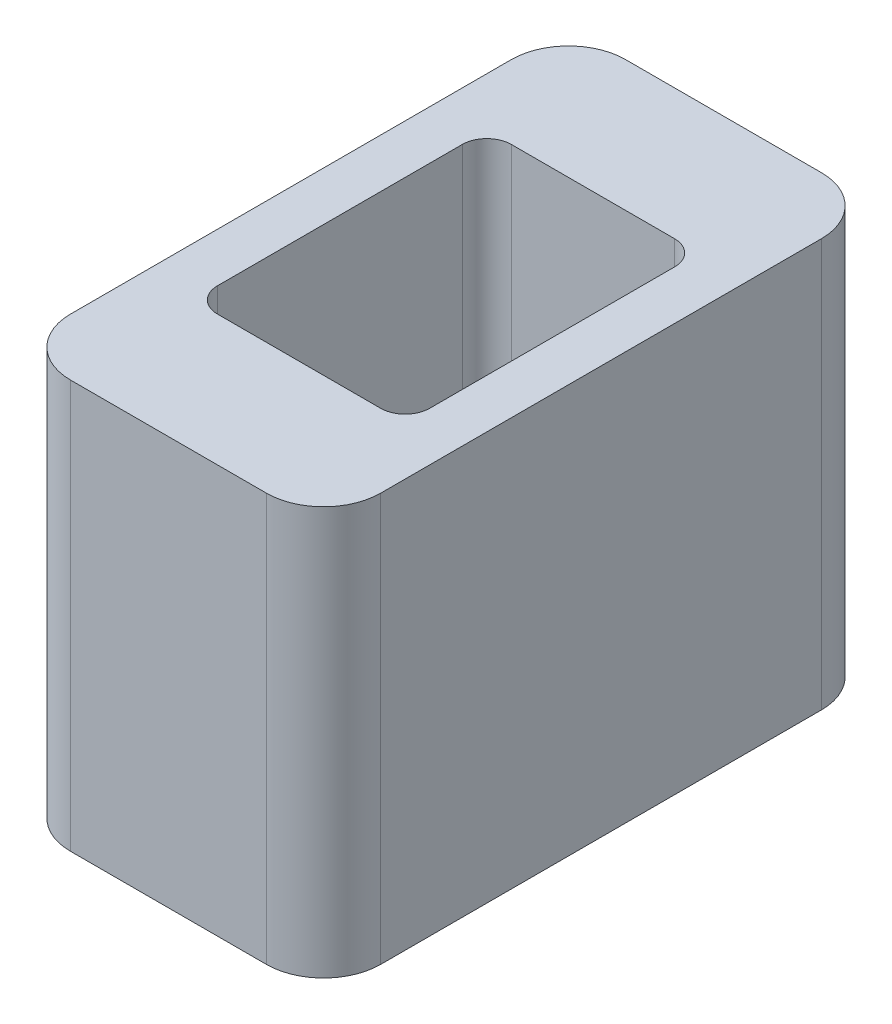
ISO-10303-21;
HEADER;
FILE_DESCRIPTION(('STEP AP214'),'2;1');
FILE_NAME('part.step','',(''),(''),'','','');
FILE_SCHEMA(('AUTOMOTIVE_DESIGN { 1 0 10303 214 1 1 1 1 }'));
ENDSEC;
DATA;
#1=APPLICATION_CONTEXT('core data for automotive mechanical design processes');
#2=APPLICATION_PROTOCOL_DEFINITION('international standard','automotive_design',2000,#1);
#3=PRODUCT_CONTEXT('',#1,'mechanical');
#4=PRODUCT('Part','Part','',(#3));
#5=PRODUCT_RELATED_PRODUCT_CATEGORY('part','',(#4));
#6=PRODUCT_DEFINITION_FORMATION('','',#4);
#7=PRODUCT_DEFINITION_CONTEXT('part definition',#1,'design');
#8=PRODUCT_DEFINITION('design','',#6,#7);
#9=PRODUCT_DEFINITION_SHAPE('','',#8);
#10=(LENGTH_UNIT() NAMED_UNIT(*) SI_UNIT(.MILLI.,.METRE.));
#11=(NAMED_UNIT(*) PLANE_ANGLE_UNIT() SI_UNIT($,.RADIAN.));
#12=(NAMED_UNIT(*) SI_UNIT($,.STERADIAN.) SOLID_ANGLE_UNIT());
#13=UNCERTAINTY_MEASURE_WITH_UNIT(LENGTH_MEASURE(1.E-05),#10,'distance_accuracy_value','');
#14=(GEOMETRIC_REPRESENTATION_CONTEXT(3) GLOBAL_UNCERTAINTY_ASSIGNED_CONTEXT((#13)) GLOBAL_UNIT_ASSIGNED_CONTEXT((#10,
#11,#12)) REPRESENTATION_CONTEXT('',''));
#15=CARTESIAN_POINT('',(0.,0.,0.));
#16=DIRECTION('',(0.,0.,1.));
#17=DIRECTION('',(1.,0.,0.));
#18=AXIS2_PLACEMENT_3D('',#15,#16,#17);
#19=CARTESIAN_POINT('',(-55.3410968965142,8.00000000000036,-55.2200768086937));
#20=DIRECTION('',(0.,-1.,0.));
#21=DIRECTION('',(-1.,0.,0.));
#22=AXIS2_PLACEMENT_3D('',#19,#20,#21);
#23=PLANE('',#22);
#24=DIRECTION('',(-1.,0.,0.));
#25=VECTOR('',#24,1.);
#26=CARTESIAN_POINT('',(3.57000000000008,8.,2.79999999999879));
#27=LINE('',#26,#25);
#28=CARTESIAN_POINT('',(3.57000000000008,8.,2.79999999999879));
#29=VERTEX_POINT('',#28);
#30=CARTESIAN_POINT('',(1.57000000000014,8.,2.79999999999879));
#31=VERTEX_POINT('',#30);
#32=EDGE_CURVE('E282',#29,#31,#27,.T.);
#33=ORIENTED_EDGE('',*,*,#32,.F.);
#34=CARTESIAN_POINT('',(3.57000000000008,8.,3.09999999999888));
#35=DIRECTION('',(0.,-1.,0.));
#36=DIRECTION('',(1.,0.,0.));
#37=AXIS2_PLACEMENT_3D('',#34,#35,#36);
#38=CIRCLE('',#37,0.300000000000047);
#39=CARTESIAN_POINT('',(3.87000000000006,7.9999999999999,3.09999999999888));
#40=VERTEX_POINT('',#39);
#41=EDGE_CURVE('E186',#29,#40,#38,.T.);
#42=ORIENTED_EDGE('',*,*,#41,.T.);
#43=DIRECTION('',(0.,0.,1.));
#44=VECTOR('',#43,1.);
#45=CARTESIAN_POINT('',(3.87000000000006,7.9999999999999,3.09999999999888));
#46=LINE('',#45,#44);
#47=CARTESIAN_POINT('',(3.87000000000006,7.9999999999999,6.09999999999889));
#48=VERTEX_POINT('',#47);
#49=EDGE_CURVE('E196',#40,#48,#46,.T.);
#50=ORIENTED_EDGE('',*,*,#49,.T.);
#51=CARTESIAN_POINT('',(3.57000000000008,8.,6.09999999999889));
#52=DIRECTION('',(0.,-1.,0.));
#53=DIRECTION('',(1.,0.,0.));
#54=AXIS2_PLACEMENT_3D('',#51,#52,#53);
#55=CIRCLE('',#54,0.29999999999994);
#56=CARTESIAN_POINT('',(3.57000000000008,8.,6.39999999999878));
#57=VERTEX_POINT('',#56);
#58=EDGE_CURVE('E177',#48,#57,#55,.T.);
#59=ORIENTED_EDGE('',*,*,#58,.T.);
#60=DIRECTION('',(1.,0.,0.));
#61=VECTOR('',#60,1.);
#62=CARTESIAN_POINT('',(1.57000000000014,8.,6.3999999999989));
#63=LINE('',#62,#61);
#64=CARTESIAN_POINT('',(1.57000000000014,8.,6.3999999999989));
#65=VERTEX_POINT('',#64);
#66=EDGE_CURVE('E223',#65,#57,#63,.T.);
#67=ORIENTED_EDGE('',*,*,#66,.F.);
#68=CARTESIAN_POINT('',(1.57000000000014,8.,6.09999999999889));
#69=DIRECTION('',(0.,-1.,0.));
#70=DIRECTION('',(1.,0.,0.));
#71=AXIS2_PLACEMENT_3D('',#68,#69,#70);
#72=CIRCLE('',#71,0.29999999999999);
#73=CARTESIAN_POINT('',(1.27000000000012,8.,6.09999999999889));
#74=VERTEX_POINT('',#73);
#75=EDGE_CURVE('E212',#65,#74,#72,.T.);
#76=ORIENTED_EDGE('',*,*,#75,.T.);
#77=DIRECTION('',(0.,0.,1.));
#78=VECTOR('',#77,1.);
#79=CARTESIAN_POINT('',(1.27000000000012,8.,3.09999999999888));
#80=LINE('',#79,#78);
#81=CARTESIAN_POINT('',(1.27000000000012,8.,3.09999999999888));
#82=VERTEX_POINT('',#81);
#83=EDGE_CURVE('E199',#82,#74,#80,.T.);
#84=ORIENTED_EDGE('',*,*,#83,.F.);
#85=CARTESIAN_POINT('',(1.57000000000014,8.,3.09999999999888));
#86=DIRECTION('',(0.,-1.,0.));
#87=DIRECTION('',(1.,0.,0.));
#88=AXIS2_PLACEMENT_3D('',#85,#86,#87);
#89=CIRCLE('',#88,0.300000000000011);
#90=EDGE_CURVE('E253',#82,#31,#89,.T.);
#91=ORIENTED_EDGE('',*,*,#90,.T.);
#92=EDGE_LOOP('',(#33,#42,#50,#59,#67,#76,#84,#91));
#93=FACE_BOUND('',#92,.T.);
#94=CARTESIAN_POINT('',(3.76999999999984,8.00000000000019,1.8999999999989));
#95=DIRECTION('',(0.,-1.,0.));
#96=DIRECTION('',(1.,0.,0.));
#97=AXIS2_PLACEMENT_3D('',#94,#95,#96);
#98=CIRCLE('',#97,0.7);
#99=CARTESIAN_POINT('',(3.76999999999984,8.00000000000019,1.19999999999879));
#100=VERTEX_POINT('',#99);
#101=CARTESIAN_POINT('',(4.47000000000017,7.99999999999989,1.8999999999989));
#102=VERTEX_POINT('',#101);
#103=EDGE_CURVE('E176',#100,#102,#98,.T.);
#104=ORIENTED_EDGE('',*,*,#103,.F.);
#105=DIRECTION('',(1.,0.,0.));
#106=VECTOR('',#105,1.);
#107=CARTESIAN_POINT('',(1.36999999999966,8.00000000000043,1.19999999999879));
#108=LINE('',#107,#106);
#109=CARTESIAN_POINT('',(1.36999999999966,8.00000000000043,1.19999999999879));
#110=VERTEX_POINT('',#109);
#111=EDGE_CURVE('E25',#110,#100,#108,.T.);
#112=ORIENTED_EDGE('',*,*,#111,.F.);
#113=CARTESIAN_POINT('',(1.36999999999966,8.00000000000043,1.8999999999989));
#114=DIRECTION('',(0.,-1.,0.));
#115=DIRECTION('',(1.,0.,0.));
#116=AXIS2_PLACEMENT_3D('',#113,#114,#115);
#117=CIRCLE('',#116,0.699999999999989);
#118=CARTESIAN_POINT('',(0.670000000000073,8.,1.8999999999989));
#119=VERTEX_POINT('',#118);
#120=EDGE_CURVE('E297',#119,#110,#117,.T.);
#121=ORIENTED_EDGE('',*,*,#120,.F.);
#122=DIRECTION('',(0.,0.,-1.));
#123=VECTOR('',#122,1.);
#124=CARTESIAN_POINT('',(0.670000000000073,8.,7.29999999999889));
#125=LINE('',#124,#123);
#126=CARTESIAN_POINT('',(0.670000000000073,8.,7.29999999999889));
#127=VERTEX_POINT('',#126);
#128=EDGE_CURVE('E296',#127,#119,#125,.T.);
#129=ORIENTED_EDGE('',*,*,#128,.F.);
#130=CARTESIAN_POINT('',(1.36999999999966,8.00000000000043,7.29999999999889));
#131=DIRECTION('',(0.,-1.,0.));
#132=DIRECTION('',(1.,0.,0.));
#133=AXIS2_PLACEMENT_3D('',#130,#131,#132);
#134=CIRCLE('',#133,0.699999999999989);
#135=CARTESIAN_POINT('',(1.36999999999966,8.00000000000043,7.99999999999889));
#136=VERTEX_POINT('',#135);
#137=EDGE_CURVE('E267',#136,#127,#134,.T.);
#138=ORIENTED_EDGE('',*,*,#137,.F.);
#139=DIRECTION('',(1.,0.,0.));
#140=VECTOR('',#139,1.);
#141=CARTESIAN_POINT('',(1.36999999999966,8.00000000000043,7.99999999999889));
#142=LINE('',#141,#140);
#143=CARTESIAN_POINT('',(3.76999999999984,8.00000000000019,7.99999999999889));
#144=VERTEX_POINT('',#143);
#145=EDGE_CURVE('E248',#136,#144,#142,.T.);
#146=ORIENTED_EDGE('',*,*,#145,.T.);
#147=CARTESIAN_POINT('',(3.76999999999984,8.00000000000019,7.29999999999889));
#148=DIRECTION('',(0.,-1.,0.));
#149=DIRECTION('',(1.,0.,0.));
#150=AXIS2_PLACEMENT_3D('',#147,#148,#149);
#151=CIRCLE('',#150,0.699999999999989);
#152=CARTESIAN_POINT('',(4.47000000000017,7.99999999999989,7.29999999999889));
#153=VERTEX_POINT('',#152);
#154=EDGE_CURVE('E240',#153,#144,#151,.T.);
#155=ORIENTED_EDGE('',*,*,#154,.F.);
#156=DIRECTION('',(0.,0.,-1.));
#157=VECTOR('',#156,1.);
#158=CARTESIAN_POINT('',(4.47000000000017,7.99999999999989,7.29999999999889));
#159=LINE('',#158,#157);
#160=EDGE_CURVE('E258',#153,#102,#159,.T.);
#161=ORIENTED_EDGE('',*,*,#160,.T.);
#162=EDGE_LOOP('',(#104,#112,#121,#129,#138,#146,#155,#161));
#163=FACE_BOUND('',#162,.T.);
#164=ADVANCED_FACE('F15',(#93,#163),#23,.F.);
#165=CARTESIAN_POINT('',(-55.3410968965141,3.00000000000021,-55.2200768086937));
#166=DIRECTION('',(0.,-1.,0.));
#167=DIRECTION('',(-1.,0.,0.));
#168=AXIS2_PLACEMENT_3D('',#165,#166,#167);
#169=PLANE('',#168);
#170=CARTESIAN_POINT('',(1.57000000000034,2.99999999999976,3.09999999999888));
#171=DIRECTION('',(0.,-1.,0.));
#172=DIRECTION('',(1.,0.,0.));
#173=AXIS2_PLACEMENT_3D('',#170,#171,#172);
#174=CIRCLE('',#173,0.300000000000011);
#175=CARTESIAN_POINT('',(1.27000000000027,2.99999999999977,3.09999999999888));
#176=VERTEX_POINT('',#175);
#177=CARTESIAN_POINT('',(1.57000000000034,2.99999999999976,2.79999999999879));
#178=VERTEX_POINT('',#177);
#179=EDGE_CURVE('E203',#176,#178,#174,.T.);
#180=ORIENTED_EDGE('',*,*,#179,.F.);
#181=DIRECTION('',(0.,0.,1.));
#182=VECTOR('',#181,1.);
#183=CARTESIAN_POINT('',(1.27000000000027,2.99999999999977,3.09999999999888));
#184=LINE('',#183,#182);
#185=CARTESIAN_POINT('',(1.27000000000027,2.99999999999977,6.09999999999889));
#186=VERTEX_POINT('',#185);
#187=EDGE_CURVE('E232',#176,#186,#184,.T.);
#188=ORIENTED_EDGE('',*,*,#187,.T.);
#189=CARTESIAN_POINT('',(1.57000000000034,2.99999999999976,6.09999999999889));
#190=DIRECTION('',(0.,-1.,0.));
#191=DIRECTION('',(1.,0.,0.));
#192=AXIS2_PLACEMENT_3D('',#189,#190,#191);
#193=CIRCLE('',#192,0.29999999999999);
#194=CARTESIAN_POINT('',(1.57000000000034,2.99999999999976,6.3999999999989));
#195=VERTEX_POINT('',#194);
#196=EDGE_CURVE('E209',#195,#186,#193,.T.);
#197=ORIENTED_EDGE('',*,*,#196,.F.);
#198=DIRECTION('',(1.,0.,0.));
#199=VECTOR('',#198,1.);
#200=CARTESIAN_POINT('',(1.57000000000034,2.99999999999976,6.3999999999989));
#201=LINE('',#200,#199);
#202=CARTESIAN_POINT('',(3.57000000000025,2.99999999999981,6.3999999999989));
#203=VERTEX_POINT('',#202);
#204=EDGE_CURVE('E171',#195,#203,#201,.T.);
#205=ORIENTED_EDGE('',*,*,#204,.T.);
#206=CARTESIAN_POINT('',(3.57000000000025,2.99999999999981,6.09999999999889));
#207=DIRECTION('',(0.,-1.,0.));
#208=DIRECTION('',(1.,0.,0.));
#209=AXIS2_PLACEMENT_3D('',#206,#207,#208);
#210=CIRCLE('',#209,0.29999999999994);
#211=CARTESIAN_POINT('',(3.87000000000023,2.99999999999975,6.09999999999889));
#212=VERTEX_POINT('',#211);
#213=EDGE_CURVE('E161',#212,#203,#210,.T.);
#214=ORIENTED_EDGE('',*,*,#213,.F.);
#215=DIRECTION('',(0.,0.,1.));
#216=VECTOR('',#215,1.);
#217=CARTESIAN_POINT('',(3.87000000000023,2.99999999999975,3.09999999999888));
#218=LINE('',#217,#216);
#219=CARTESIAN_POINT('',(3.87000000000023,2.99999999999975,3.09999999999888));
#220=VERTEX_POINT('',#219);
#221=EDGE_CURVE('E168',#220,#212,#218,.T.);
#222=ORIENTED_EDGE('',*,*,#221,.F.);
#223=CARTESIAN_POINT('',(3.57000000000025,2.99999999999981,3.09999999999888));
#224=DIRECTION('',(0.,-1.,0.));
#225=DIRECTION('',(1.,0.,0.));
#226=AXIS2_PLACEMENT_3D('',#223,#224,#225);
#227=CIRCLE('',#226,0.300000000000047);
#228=CARTESIAN_POINT('',(3.57000000000025,2.99999999999981,2.79999999999879));
#229=VERTEX_POINT('',#228);
#230=EDGE_CURVE('E227',#229,#220,#227,.T.);
#231=ORIENTED_EDGE('',*,*,#230,.F.);
#232=DIRECTION('',(-1.,0.,0.));
#233=VECTOR('',#232,1.);
#234=CARTESIAN_POINT('',(3.57000000000025,2.99999999999981,2.79999999999879));
#235=LINE('',#234,#233);
#236=EDGE_CURVE('E277',#229,#178,#235,.T.);
#237=ORIENTED_EDGE('',*,*,#236,.T.);
#238=EDGE_LOOP('',(#180,#188,#197,#205,#214,#222,#231,#237));
#239=FACE_BOUND('',#238,.T.);
#240=DIRECTION('',(0.,0.,-1.));
#241=VECTOR('',#240,1.);
#242=CARTESIAN_POINT('',(4.46999999999966,3.00000000000045,7.29999999999889));
#243=LINE('',#242,#241);
#244=CARTESIAN_POINT('',(4.46999999999966,3.00000000000045,7.29999999999889));
#245=VERTEX_POINT('',#244);
#246=CARTESIAN_POINT('',(4.46999999999966,3.00000000000045,1.8999999999989));
#247=VERTEX_POINT('',#246);
#248=EDGE_CURVE('E244',#245,#247,#243,.T.);
#249=ORIENTED_EDGE('',*,*,#248,.F.);
#250=CARTESIAN_POINT('',(3.77,3.,7.29999999999889));
#251=DIRECTION('',(0.,-1.,0.));
#252=DIRECTION('',(1.,0.,0.));
#253=AXIS2_PLACEMENT_3D('',#250,#251,#252);
#254=CIRCLE('',#253,0.699999999999989);
#255=CARTESIAN_POINT('',(3.77,3.,7.99999999999889));
#256=VERTEX_POINT('',#255);
#257=EDGE_CURVE('E239',#245,#256,#254,.T.);
#258=ORIENTED_EDGE('',*,*,#257,.T.);
#259=DIRECTION('',(1.,0.,0.));
#260=VECTOR('',#259,1.);
#261=CARTESIAN_POINT('',(1.36999999999986,3.00000000000025,7.99999999999889));
#262=LINE('',#261,#260);
#263=CARTESIAN_POINT('',(1.36999999999986,3.00000000000025,7.99999999999889));
#264=VERTEX_POINT('',#263);
#265=EDGE_CURVE('E264',#264,#256,#262,.T.);
#266=ORIENTED_EDGE('',*,*,#265,.F.);
#267=CARTESIAN_POINT('',(1.36999999999986,3.00000000000025,7.29999999999889));
#268=DIRECTION('',(0.,-1.,0.));
#269=DIRECTION('',(1.,0.,0.));
#270=AXIS2_PLACEMENT_3D('',#267,#268,#269);
#271=CIRCLE('',#270,0.699999999999989);
#272=CARTESIAN_POINT('',(0.670000000000243,2.99999999999985,7.29999999999889));
#273=VERTEX_POINT('',#272);
#274=EDGE_CURVE('E301',#264,#273,#271,.T.);
#275=ORIENTED_EDGE('',*,*,#274,.T.);
#276=DIRECTION('',(0.,0.,-1.));
#277=VECTOR('',#276,1.);
#278=CARTESIAN_POINT('',(0.670000000000243,2.99999999999985,7.29999999999889));
#279=LINE('',#278,#277);
#280=CARTESIAN_POINT('',(0.670000000000243,2.99999999999985,1.8999999999989));
#281=VERTEX_POINT('',#280);
#282=EDGE_CURVE('E295',#273,#281,#279,.T.);
#283=ORIENTED_EDGE('',*,*,#282,.T.);
#284=CARTESIAN_POINT('',(1.36999999999986,3.00000000000025,1.8999999999989));
#285=DIRECTION('',(0.,-1.,0.));
#286=DIRECTION('',(1.,0.,0.));
#287=AXIS2_PLACEMENT_3D('',#284,#285,#286);
#288=CIRCLE('',#287,0.699999999999989);
#289=CARTESIAN_POINT('',(1.36999999999986,3.00000000000025,1.19999999999879));
#290=VERTEX_POINT('',#289);
#291=EDGE_CURVE('E216',#281,#290,#288,.T.);
#292=ORIENTED_EDGE('',*,*,#291,.T.);
#293=DIRECTION('',(1.,0.,0.));
#294=VECTOR('',#293,1.);
#295=CARTESIAN_POINT('',(1.36999999999986,3.00000000000025,1.19999999999879));
#296=LINE('',#295,#294);
#297=CARTESIAN_POINT('',(3.77,3.,1.19999999999879));
#298=VERTEX_POINT('',#297);
#299=EDGE_CURVE('E10',#290,#298,#296,.T.);
#300=ORIENTED_EDGE('',*,*,#299,.T.);
#301=CARTESIAN_POINT('',(3.77,3.,1.8999999999989));
#302=DIRECTION('',(0.,-1.,0.));
#303=DIRECTION('',(1.,0.,0.));
#304=AXIS2_PLACEMENT_3D('',#301,#302,#303);
#305=CIRCLE('',#304,0.7);
#306=EDGE_CURVE('E208',#298,#247,#305,.T.);
#307=ORIENTED_EDGE('',*,*,#306,.T.);
#308=EDGE_LOOP('',(#249,#258,#266,#275,#283,#292,#300,#307));
#309=FACE_BOUND('',#308,.T.);
#310=ADVANCED_FACE('F164',(#239,#309),#169,.T.);
#311=CARTESIAN_POINT('',(3.76999999999984,8.00000000000019,1.19999999999879));
#312=DIRECTION('',(0.,0.,-1.));
#313=DIRECTION('',(0.707106781186542,-0.707106781186553,0.));
#314=AXIS2_PLACEMENT_3D('',#311,#312,#313);
#315=PLANE('',#314);
#316=ORIENTED_EDGE('',*,*,#111,.T.);
#317=DIRECTION('',(0.,-1.,0.));
#318=VECTOR('',#317,1.);
#319=CARTESIAN_POINT('',(3.76999999999984,8.00000000000019,1.19999999999879));
#320=LINE('',#319,#318);
#321=EDGE_CURVE('E271',#100,#298,#320,.T.);
#322=ORIENTED_EDGE('',*,*,#321,.T.);
#323=ORIENTED_EDGE('',*,*,#299,.F.);
#324=DIRECTION('',(0.,-1.,0.));
#325=VECTOR('',#324,1.);
#326=CARTESIAN_POINT('',(1.36999999999966,8.00000000000043,1.19999999999879));
#327=LINE('',#326,#325);
#328=EDGE_CURVE('E18',#110,#290,#327,.T.);
#329=ORIENTED_EDGE('',*,*,#328,.F.);
#330=EDGE_LOOP('',(#316,#322,#323,#329));
#331=FACE_BOUND('',#330,.T.);
#332=ADVANCED_FACE('F372',(#331),#315,.T.);
#333=CARTESIAN_POINT('',(1.36999999999966,8.00000000000043,1.8999999999989));
#334=DIRECTION('',(0.,-1.,0.));
#335=DIRECTION('',(1.,0.,0.));
#336=AXIS2_PLACEMENT_3D('',#333,#334,#335);
#337=CYLINDRICAL_SURFACE('',#336,0.699999999999989);
#338=ORIENTED_EDGE('',*,*,#120,.T.);
#339=ORIENTED_EDGE('',*,*,#328,.T.);
#340=ORIENTED_EDGE('',*,*,#291,.F.);
#341=DIRECTION('',(0.,-1.,0.));
#342=VECTOR('',#341,1.);
#343=CARTESIAN_POINT('',(0.670000000000073,8.,1.8999999999989));
#344=LINE('',#343,#342);
#345=EDGE_CURVE('E291',#119,#281,#344,.T.);
#346=ORIENTED_EDGE('',*,*,#345,.F.);
#347=EDGE_LOOP('',(#338,#339,#340,#346));
#348=FACE_BOUND('',#347,.T.);
#349=ADVANCED_FACE('F352',(#348),#337,.T.);
#350=CARTESIAN_POINT('',(0.670000000000073,8.,1.8999999999989));
#351=DIRECTION('',(-1.,0.,0.));
#352=DIRECTION('',(0.,0.,1.));
#353=AXIS2_PLACEMENT_3D('',#350,#351,#352);
#354=PLANE('',#353);
#355=ORIENTED_EDGE('',*,*,#128,.T.);
#356=ORIENTED_EDGE('',*,*,#345,.T.);
#357=ORIENTED_EDGE('',*,*,#282,.F.);
#358=DIRECTION('',(0.,-1.,0.));
#359=VECTOR('',#358,1.);
#360=CARTESIAN_POINT('',(0.670000000000073,8.,7.29999999999889));
#361=LINE('',#360,#359);
#362=EDGE_CURVE('E305',#127,#273,#361,.T.);
#363=ORIENTED_EDGE('',*,*,#362,.F.);
#364=EDGE_LOOP('',(#355,#356,#357,#363));
#365=FACE_BOUND('',#364,.T.);
#366=ADVANCED_FACE('F345',(#365),#354,.T.);
#367=CARTESIAN_POINT('',(1.36999999999966,8.00000000000043,7.29999999999889));
#368=DIRECTION('',(0.,-1.,0.));
#369=DIRECTION('',(1.,0.,0.));
#370=AXIS2_PLACEMENT_3D('',#367,#368,#369);
#371=CYLINDRICAL_SURFACE('',#370,0.699999999999989);
#372=ORIENTED_EDGE('',*,*,#137,.T.);
#373=ORIENTED_EDGE('',*,*,#362,.T.);
#374=ORIENTED_EDGE('',*,*,#274,.F.);
#375=DIRECTION('',(0.,-1.,0.));
#376=VECTOR('',#375,1.);
#377=CARTESIAN_POINT('',(1.36999999999966,8.00000000000043,7.99999999999889));
#378=LINE('',#377,#376);
#379=EDGE_CURVE('E263',#136,#264,#378,.T.);
#380=ORIENTED_EDGE('',*,*,#379,.F.);
#381=EDGE_LOOP('',(#372,#373,#374,#380));
#382=FACE_BOUND('',#381,.T.);
#383=ADVANCED_FACE('F356',(#382),#371,.T.);
#384=CARTESIAN_POINT('',(1.36999999999966,8.00000000000043,7.99999999999889));
#385=DIRECTION('',(0.,0.,1.));
#386=DIRECTION('',(0.707106781186553,0.707106781186542,0.));
#387=AXIS2_PLACEMENT_3D('',#384,#385,#386);
#388=PLANE('',#387);
#389=DIRECTION('',(0.,-1.,0.));
#390=VECTOR('',#389,1.);
#391=CARTESIAN_POINT('',(3.76999999999984,8.00000000000019,7.99999999999889));
#392=LINE('',#391,#390);
#393=EDGE_CURVE('E235',#144,#256,#392,.T.);
#394=ORIENTED_EDGE('',*,*,#393,.F.);
#395=ORIENTED_EDGE('',*,*,#145,.F.);
#396=ORIENTED_EDGE('',*,*,#379,.T.);
#397=ORIENTED_EDGE('',*,*,#265,.T.);
#398=EDGE_LOOP('',(#394,#395,#396,#397));
#399=FACE_BOUND('',#398,.T.);
#400=ADVANCED_FACE('F360',(#399),#388,.T.);
#401=CARTESIAN_POINT('',(3.76999999999984,8.00000000000019,7.29999999999889));
#402=DIRECTION('',(0.,-1.,0.));
#403=DIRECTION('',(1.,0.,0.));
#404=AXIS2_PLACEMENT_3D('',#401,#402,#403);
#405=CYLINDRICAL_SURFACE('',#404,0.699999999999989);
#406=ORIENTED_EDGE('',*,*,#154,.T.);
#407=ORIENTED_EDGE('',*,*,#393,.T.);
#408=ORIENTED_EDGE('',*,*,#257,.F.);
#409=DIRECTION('',(0.,-1.,0.));
#410=VECTOR('',#409,1.);
#411=CARTESIAN_POINT('',(4.47000000000017,7.99999999999989,7.29999999999889));
#412=LINE('',#411,#410);
#413=EDGE_CURVE('E254',#153,#245,#412,.T.);
#414=ORIENTED_EDGE('',*,*,#413,.F.);
#415=EDGE_LOOP('',(#406,#407,#408,#414));
#416=FACE_BOUND('',#415,.T.);
#417=ADVANCED_FACE('F365',(#416),#405,.T.);
#418=CARTESIAN_POINT('',(4.47000000000017,7.99999999999989,7.29999999999889));
#419=DIRECTION('',(1.,0.,0.));
#420=DIRECTION('',(0.,0.,-1.));
#421=AXIS2_PLACEMENT_3D('',#418,#419,#420);
#422=PLANE('',#421);
#423=ORIENTED_EDGE('',*,*,#160,.F.);
#424=ORIENTED_EDGE('',*,*,#413,.T.);
#425=ORIENTED_EDGE('',*,*,#248,.T.);
#426=DIRECTION('',(0.,-1.,0.));
#427=VECTOR('',#426,1.);
#428=CARTESIAN_POINT('',(4.47000000000017,7.99999999999989,1.8999999999989));
#429=LINE('',#428,#427);
#430=EDGE_CURVE('E204',#102,#247,#429,.T.);
#431=ORIENTED_EDGE('',*,*,#430,.F.);
#432=EDGE_LOOP('',(#423,#424,#425,#431));
#433=FACE_BOUND('',#432,.T.);
#434=ADVANCED_FACE('F367',(#433),#422,.T.);
#435=CARTESIAN_POINT('',(3.76999999999984,8.00000000000019,1.8999999999989));
#436=DIRECTION('',(0.,-1.,0.));
#437=DIRECTION('',(1.,0.,0.));
#438=AXIS2_PLACEMENT_3D('',#435,#436,#437);
#439=CYLINDRICAL_SURFACE('',#438,0.7);
#440=ORIENTED_EDGE('',*,*,#103,.T.);
#441=ORIENTED_EDGE('',*,*,#430,.T.);
#442=ORIENTED_EDGE('',*,*,#306,.F.);
#443=ORIENTED_EDGE('',*,*,#321,.F.);
#444=EDGE_LOOP('',(#440,#441,#442,#443));
#445=FACE_BOUND('',#444,.T.);
#446=ADVANCED_FACE('F371',(#445),#439,.T.);
#447=CARTESIAN_POINT('',(3.57000000000008,8.,6.09999999999889));
#448=DIRECTION('',(0.,-1.,0.));
#449=DIRECTION('',(1.,0.,0.));
#450=AXIS2_PLACEMENT_3D('',#447,#448,#449);
#451=CYLINDRICAL_SURFACE('',#450,0.29999999999994);
#452=DIRECTION('',(0.,-1.,0.));
#453=VECTOR('',#452,1.);
#454=CARTESIAN_POINT('',(3.57000000000008,8.,6.3999999999989));
#455=LINE('',#454,#453);
#456=EDGE_CURVE('E288',#57,#203,#455,.T.);
#457=ORIENTED_EDGE('',*,*,#456,.F.);
#458=ORIENTED_EDGE('',*,*,#58,.F.);
#459=DIRECTION('',(0.,-1.,0.));
#460=VECTOR('',#459,1.);
#461=CARTESIAN_POINT('',(3.87000000000006,7.9999999999999,6.09999999999889));
#462=LINE('',#461,#460);
#463=EDGE_CURVE('E180',#48,#212,#462,.T.);
#464=ORIENTED_EDGE('',*,*,#463,.T.);
#465=ORIENTED_EDGE('',*,*,#213,.T.);
#466=EDGE_LOOP('',(#457,#458,#464,#465));
#467=FACE_BOUND('',#466,.T.);
#468=ADVANCED_FACE('F181',(#467),#451,.F.);
#469=CARTESIAN_POINT('',(3.57000000000008,8.,6.3999999999989));
#470=DIRECTION('',(0.,0.,-1.));
#471=DIRECTION('',(0.707106781186542,-0.707106781186553,0.));
#472=AXIS2_PLACEMENT_3D('',#469,#470,#471);
#473=PLANE('',#472);
#474=ORIENTED_EDGE('',*,*,#456,.T.);
#475=ORIENTED_EDGE('',*,*,#204,.F.);
#476=DIRECTION('',(0.,-1.,0.));
#477=VECTOR('',#476,1.);
#478=CARTESIAN_POINT('',(1.57000000000014,8.,6.3999999999989));
#479=LINE('',#478,#477);
#480=EDGE_CURVE('E213',#65,#195,#479,.T.);
#481=ORIENTED_EDGE('',*,*,#480,.F.);
#482=ORIENTED_EDGE('',*,*,#66,.T.);
#483=EDGE_LOOP('',(#474,#475,#481,#482));
#484=FACE_BOUND('',#483,.T.);
#485=ADVANCED_FACE('F422',(#484),#473,.T.);
#486=CARTESIAN_POINT('',(1.57000000000014,8.,6.09999999999889));
#487=DIRECTION('',(0.,-1.,0.));
#488=DIRECTION('',(1.,0.,0.));
#489=AXIS2_PLACEMENT_3D('',#486,#487,#488);
#490=CYLINDRICAL_SURFACE('',#489,0.29999999999999);
#491=ORIENTED_EDGE('',*,*,#480,.T.);
#492=ORIENTED_EDGE('',*,*,#196,.T.);
#493=DIRECTION('',(0.,-1.,0.));
#494=VECTOR('',#493,1.);
#495=CARTESIAN_POINT('',(1.27000000000012,8.,6.09999999999889));
#496=LINE('',#495,#494);
#497=EDGE_CURVE('E202',#74,#186,#496,.T.);
#498=ORIENTED_EDGE('',*,*,#497,.F.);
#499=ORIENTED_EDGE('',*,*,#75,.F.);
#500=EDGE_LOOP('',(#491,#492,#498,#499));
#501=FACE_BOUND('',#500,.T.);
#502=ADVANCED_FACE('F414',(#501),#490,.F.);
#503=CARTESIAN_POINT('',(1.27000000000012,8.,6.09999999999889));
#504=DIRECTION('',(1.,0.,0.));
#505=DIRECTION('',(0.,0.,-1.));
#506=AXIS2_PLACEMENT_3D('',#503,#504,#505);
#507=PLANE('',#506);
#508=ORIENTED_EDGE('',*,*,#83,.T.);
#509=ORIENTED_EDGE('',*,*,#497,.T.);
#510=ORIENTED_EDGE('',*,*,#187,.F.);
#511=DIRECTION('',(0.,-1.,0.));
#512=VECTOR('',#511,1.);
#513=CARTESIAN_POINT('',(1.27000000000012,8.,3.09999999999888));
#514=LINE('',#513,#512);
#515=EDGE_CURVE('E249',#82,#176,#514,.T.);
#516=ORIENTED_EDGE('',*,*,#515,.F.);
#517=EDGE_LOOP('',(#508,#509,#510,#516));
#518=FACE_BOUND('',#517,.T.);
#519=ADVANCED_FACE('F408',(#518),#507,.T.);
#520=CARTESIAN_POINT('',(1.57000000000014,8.,3.09999999999888));
#521=DIRECTION('',(0.,-1.,0.));
#522=DIRECTION('',(1.,0.,0.));
#523=AXIS2_PLACEMENT_3D('',#520,#521,#522);
#524=CYLINDRICAL_SURFACE('',#523,0.300000000000011);
#525=ORIENTED_EDGE('',*,*,#90,.F.);
#526=ORIENTED_EDGE('',*,*,#515,.T.);
#527=ORIENTED_EDGE('',*,*,#179,.T.);
#528=DIRECTION('',(0.,-1.,0.));
#529=VECTOR('',#528,1.);
#530=CARTESIAN_POINT('',(1.57000000000014,8.,2.79999999999879));
#531=LINE('',#530,#529);
#532=EDGE_CURVE('E278',#31,#178,#531,.T.);
#533=ORIENTED_EDGE('',*,*,#532,.F.);
#534=EDGE_LOOP('',(#525,#526,#527,#533));
#535=FACE_BOUND('',#534,.T.);
#536=ADVANCED_FACE('F413',(#535),#524,.F.);
#537=CARTESIAN_POINT('',(1.57000000000014,8.,2.79999999999879));
#538=DIRECTION('',(0.,0.,1.));
#539=DIRECTION('',(0.707106781186553,0.707106781186542,0.));
#540=AXIS2_PLACEMENT_3D('',#537,#538,#539);
#541=PLANE('',#540);
#542=ORIENTED_EDGE('',*,*,#32,.T.);
#543=ORIENTED_EDGE('',*,*,#532,.T.);
#544=ORIENTED_EDGE('',*,*,#236,.F.);
#545=DIRECTION('',(0.,-1.,0.));
#546=VECTOR('',#545,1.);
#547=CARTESIAN_POINT('',(3.57000000000008,8.,2.79999999999879));
#548=LINE('',#547,#546);
#549=EDGE_CURVE('E224',#29,#229,#548,.T.);
#550=ORIENTED_EDGE('',*,*,#549,.F.);
#551=EDGE_LOOP('',(#542,#543,#544,#550));
#552=FACE_BOUND('',#551,.T.);
#553=ADVANCED_FACE('F435',(#552),#541,.T.);
#554=CARTESIAN_POINT('',(3.57000000000008,8.,3.09999999999888));
#555=DIRECTION('',(0.,-1.,0.));
#556=DIRECTION('',(1.,0.,0.));
#557=AXIS2_PLACEMENT_3D('',#554,#555,#556);
#558=CYLINDRICAL_SURFACE('',#557,0.300000000000047);
#559=ORIENTED_EDGE('',*,*,#41,.F.);
#560=ORIENTED_EDGE('',*,*,#549,.T.);
#561=ORIENTED_EDGE('',*,*,#230,.T.);
#562=DIRECTION('',(0.,-1.,0.));
#563=VECTOR('',#562,1.);
#564=CARTESIAN_POINT('',(3.87000000000006,7.9999999999999,3.09999999999888));
#565=LINE('',#564,#563);
#566=EDGE_CURVE('E190',#40,#220,#565,.T.);
#567=ORIENTED_EDGE('',*,*,#566,.F.);
#568=EDGE_LOOP('',(#559,#560,#561,#567));
#569=FACE_BOUND('',#568,.T.);
#570=ADVANCED_FACE('F469',(#569),#558,.F.);
#571=CARTESIAN_POINT('',(3.87000000000006,7.9999999999999,3.09999999999888));
#572=DIRECTION('',(-1.,0.,0.));
#573=DIRECTION('',(0.,0.,1.));
#574=AXIS2_PLACEMENT_3D('',#571,#572,#573);
#575=PLANE('',#574);
#576=ORIENTED_EDGE('',*,*,#49,.F.);
#577=ORIENTED_EDGE('',*,*,#566,.T.);
#578=ORIENTED_EDGE('',*,*,#221,.T.);
#579=ORIENTED_EDGE('',*,*,#463,.F.);
#580=EDGE_LOOP('',(#576,#577,#578,#579));
#581=FACE_BOUND('',#580,.T.);
#582=ADVANCED_FACE('F188',(#581),#575,.T.);
#583=CLOSED_SHELL('',(#164,#310,#332,#349,#366,#383,#400,#417,#434,#446,#468,#485,#502,#519,
#536,#553,#570,#582));
#584=MANIFOLD_SOLID_BREP('B1',#583);
#585=ADVANCED_BREP_SHAPE_REPRESENTATION('',(#18,#584),#14);
#586=SHAPE_DEFINITION_REPRESENTATION(#9,#585);
ENDSEC;
END-ISO-10303-21;
